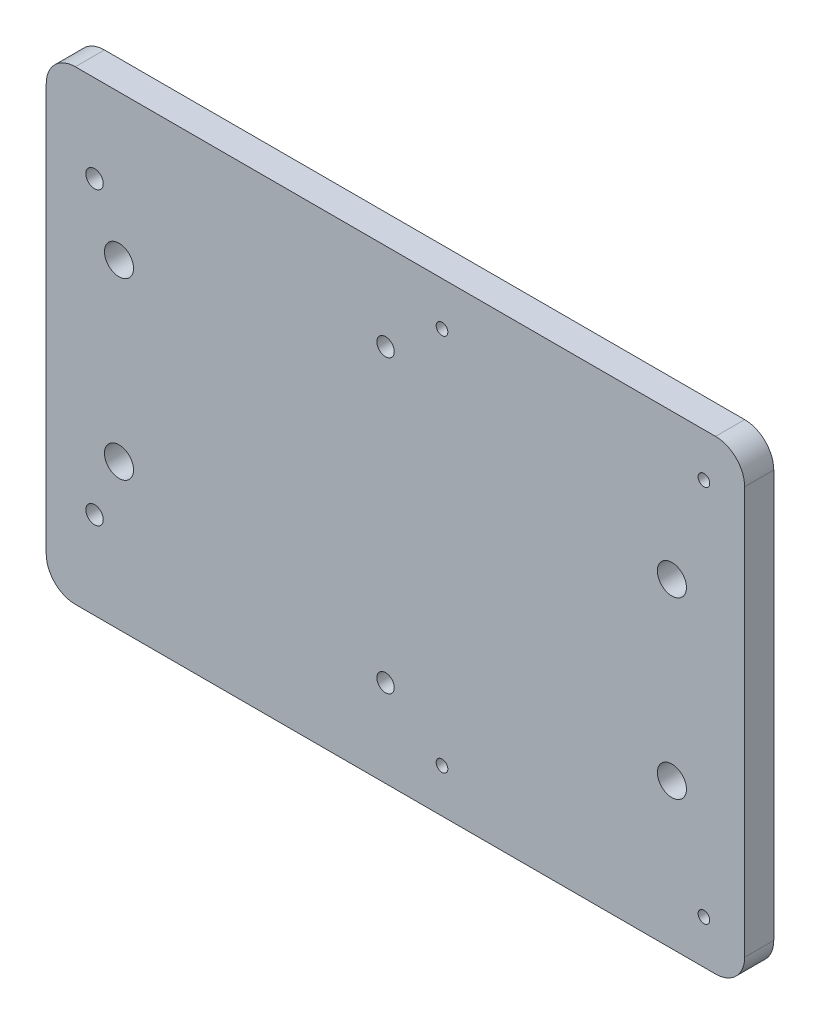
ISO-10303-21;
HEADER;
FILE_DESCRIPTION(('STEP AP214'),'2;1');
FILE_NAME('part.step','',(''),(''),'','','');
FILE_SCHEMA(('AUTOMOTIVE_DESIGN { 1 0 10303 214 1 1 1 1 }'));
ENDSEC;
DATA;
#1=APPLICATION_CONTEXT('core data for automotive mechanical design processes');
#2=APPLICATION_PROTOCOL_DEFINITION('international standard','automotive_design',2000,#1);
#3=PRODUCT_CONTEXT('',#1,'mechanical');
#4=PRODUCT('Part','Part','',(#3));
#5=PRODUCT_RELATED_PRODUCT_CATEGORY('part','',(#4));
#6=PRODUCT_DEFINITION_FORMATION('','',#4);
#7=PRODUCT_DEFINITION_CONTEXT('part definition',#1,'design');
#8=PRODUCT_DEFINITION('design','',#6,#7);
#9=PRODUCT_DEFINITION_SHAPE('','',#8);
#10=(LENGTH_UNIT() NAMED_UNIT(*) SI_UNIT(.MILLI.,.METRE.));
#11=(NAMED_UNIT(*) PLANE_ANGLE_UNIT() SI_UNIT($,.RADIAN.));
#12=(NAMED_UNIT(*) SI_UNIT($,.STERADIAN.) SOLID_ANGLE_UNIT());
#13=UNCERTAINTY_MEASURE_WITH_UNIT(LENGTH_MEASURE(1.E-05),#10,'distance_accuracy_value','');
#14=(GEOMETRIC_REPRESENTATION_CONTEXT(3) GLOBAL_UNCERTAINTY_ASSIGNED_CONTEXT((#13)) GLOBAL_UNIT_ASSIGNED_CONTEXT((#10,
#11,#12)) REPRESENTATION_CONTEXT('',''));
#15=CARTESIAN_POINT('',(0.,0.,0.));
#16=DIRECTION('',(0.,0.,1.));
#17=DIRECTION('',(1.,0.,0.));
#18=AXIS2_PLACEMENT_3D('',#15,#16,#17);
#19=CARTESIAN_POINT('',(0.,0.,5.));
#20=DIRECTION('',(0.,0.,1.));
#21=DIRECTION('',(1.,0.,0.));
#22=AXIS2_PLACEMENT_3D('',#19,#20,#21);
#23=PLANE('',#22);
#24=CARTESIAN_POINT('',(7.99999999999997,-32.5,5.));
#25=DIRECTION('',(0.,0.,1.));
#26=DIRECTION('',(1.,0.,0.));
#27=AXIS2_PLACEMENT_3D('',#24,#25,#26);
#28=CIRCLE('',#27,0.999999999999998);
#29=CARTESIAN_POINT('',(8.99999999999997,-32.5,5.));
#30=VERTEX_POINT('',#29);
#31=EDGE_CURVE('E196',#30,#30,#28,.T.);
#32=ORIENTED_EDGE('',*,*,#31,.F.);
#33=EDGE_LOOP('',(#32));
#34=FACE_BOUND('',#33,.T.);
#35=CARTESIAN_POINT('',(-51.7022512528769,25.,5.));
#36=DIRECTION('',(0.,0.,1.));
#37=DIRECTION('',(1.,0.,0.));
#38=AXIS2_PLACEMENT_3D('',#35,#36,#37);
#39=CIRCLE('',#38,1.5);
#40=CARTESIAN_POINT('',(-50.2022512528769,25.,5.));
#41=VERTEX_POINT('',#40);
#42=EDGE_CURVE('E201',#41,#41,#39,.T.);
#43=ORIENTED_EDGE('',*,*,#42,.F.);
#44=EDGE_LOOP('',(#43));
#45=FACE_BOUND('',#44,.T.);
#46=CARTESIAN_POINT('',(-1.70225125287687,25.,5.));
#47=DIRECTION('',(0.,0.,1.));
#48=DIRECTION('',(1.,0.,0.));
#49=AXIS2_PLACEMENT_3D('',#46,#47,#48);
#50=CIRCLE('',#49,1.5);
#51=CARTESIAN_POINT('',(-0.202251252876872,25.,5.));
#52=VERTEX_POINT('',#51);
#53=EDGE_CURVE('E204',#52,#52,#50,.T.);
#54=ORIENTED_EDGE('',*,*,#53,.F.);
#55=EDGE_LOOP('',(#54));
#56=FACE_BOUND('',#55,.T.);
#57=CARTESIAN_POINT('',(-1.70225125287687,-25.,5.));
#58=DIRECTION('',(0.,0.,1.));
#59=DIRECTION('',(1.,0.,0.));
#60=AXIS2_PLACEMENT_3D('',#57,#58,#59);
#61=CIRCLE('',#60,1.5);
#62=CARTESIAN_POINT('',(-0.202251252876865,-25.,5.));
#63=VERTEX_POINT('',#62);
#64=EDGE_CURVE('E207',#63,#63,#61,.T.);
#65=ORIENTED_EDGE('',*,*,#64,.F.);
#66=EDGE_LOOP('',(#65));
#67=FACE_BOUND('',#66,.T.);
#68=CARTESIAN_POINT('',(53.,-32.5,5.));
#69=DIRECTION('',(0.,0.,1.));
#70=DIRECTION('',(1.,0.,0.));
#71=AXIS2_PLACEMENT_3D('',#68,#69,#70);
#72=CIRCLE('',#71,0.999999999999998);
#73=CARTESIAN_POINT('',(54.,-32.5,5.));
#74=VERTEX_POINT('',#73);
#75=EDGE_CURVE('E210',#74,#74,#72,.T.);
#76=ORIENTED_EDGE('',*,*,#75,.F.);
#77=EDGE_LOOP('',(#76));
#78=FACE_BOUND('',#77,.T.);
#79=CARTESIAN_POINT('',(53.,32.5,5.));
#80=DIRECTION('',(0.,0.,1.));
#81=DIRECTION('',(1.,0.,0.));
#82=AXIS2_PLACEMENT_3D('',#79,#80,#81);
#83=CIRCLE('',#82,0.999999999999998);
#84=CARTESIAN_POINT('',(54.,32.5,5.));
#85=VERTEX_POINT('',#84);
#86=EDGE_CURVE('E213',#85,#85,#83,.T.);
#87=ORIENTED_EDGE('',*,*,#86,.F.);
#88=EDGE_LOOP('',(#87));
#89=FACE_BOUND('',#88,.T.);
#90=CARTESIAN_POINT('',(7.99999999999997,32.5,5.));
#91=DIRECTION('',(0.,0.,1.));
#92=DIRECTION('',(1.,0.,0.));
#93=AXIS2_PLACEMENT_3D('',#90,#91,#92);
#94=CIRCLE('',#93,0.999999999999998);
#95=CARTESIAN_POINT('',(8.99999999999996,32.5,5.));
#96=VERTEX_POINT('',#95);
#97=EDGE_CURVE('E216',#96,#96,#94,.T.);
#98=ORIENTED_EDGE('',*,*,#97,.F.);
#99=EDGE_LOOP('',(#98));
#100=FACE_BOUND('',#99,.T.);
#101=CARTESIAN_POINT('',(-51.7022512528769,-25.,5.));
#102=DIRECTION('',(0.,0.,1.));
#103=DIRECTION('',(1.,0.,0.));
#104=AXIS2_PLACEMENT_3D('',#101,#102,#103);
#105=CIRCLE('',#104,1.5);
#106=CARTESIAN_POINT('',(-50.2022512528769,-25.,5.));
#107=VERTEX_POINT('',#106);
#108=EDGE_CURVE('E219',#107,#107,#105,.T.);
#109=ORIENTED_EDGE('',*,*,#108,.F.);
#110=EDGE_LOOP('',(#109));
#111=FACE_BOUND('',#110,.T.);
#112=CARTESIAN_POINT('',(47.5,-15.,5.));
#113=DIRECTION('',(0.,0.,1.));
#114=DIRECTION('',(1.,0.,0.));
#115=AXIS2_PLACEMENT_3D('',#112,#113,#114);
#116=CIRCLE('',#115,2.49999999999999);
#117=CARTESIAN_POINT('',(50.,-15.,5.));
#118=VERTEX_POINT('',#117);
#119=EDGE_CURVE('E184',#118,#118,#116,.T.);
#120=ORIENTED_EDGE('',*,*,#119,.F.);
#121=EDGE_LOOP('',(#120));
#122=FACE_BOUND('',#121,.T.);
#123=CARTESIAN_POINT('',(-47.5,15.,5.));
#124=DIRECTION('',(0.,0.,1.));
#125=DIRECTION('',(1.,0.,0.));
#126=AXIS2_PLACEMENT_3D('',#123,#124,#125);
#127=CIRCLE('',#126,2.49999999999999);
#128=CARTESIAN_POINT('',(-45.,15.,5.));
#129=VERTEX_POINT('',#128);
#130=EDGE_CURVE('E167',#129,#129,#127,.T.);
#131=ORIENTED_EDGE('',*,*,#130,.F.);
#132=EDGE_LOOP('',(#131));
#133=FACE_BOUND('',#132,.T.);
#134=DIRECTION('',(0.,-1.,0.));
#135=VECTOR('',#134,1.);
#136=CARTESIAN_POINT('',(-60.,40.,5.));
#137=LINE('',#136,#135);
#138=CARTESIAN_POINT('',(-60.,35.,5.));
#139=VERTEX_POINT('',#138);
#140=CARTESIAN_POINT('',(-60.,-35.,5.));
#141=VERTEX_POINT('',#140);
#142=EDGE_CURVE('E174',#139,#141,#137,.T.);
#143=ORIENTED_EDGE('',*,*,#142,.T.);
#144=CARTESIAN_POINT('',(-55.,-35.,5.));
#145=DIRECTION('',(0.,0.,1.));
#146=DIRECTION('',(1.,0.,0.));
#147=AXIS2_PLACEMENT_3D('',#144,#145,#146);
#148=CIRCLE('',#147,5.);
#149=CARTESIAN_POINT('',(-55.,-40.,5.));
#150=VERTEX_POINT('',#149);
#151=EDGE_CURVE('E151',#141,#150,#148,.T.);
#152=ORIENTED_EDGE('',*,*,#151,.T.);
#153=DIRECTION('',(1.,0.,0.));
#154=VECTOR('',#153,1.);
#155=CARTESIAN_POINT('',(-60.,-40.,5.));
#156=LINE('',#155,#154);
#157=CARTESIAN_POINT('',(55.,-40.,5.));
#158=VERTEX_POINT('',#157);
#159=EDGE_CURVE('E122',#150,#158,#156,.T.);
#160=ORIENTED_EDGE('',*,*,#159,.T.);
#161=CARTESIAN_POINT('',(55.,-35.,5.));
#162=DIRECTION('',(0.,0.,1.));
#163=DIRECTION('',(1.,0.,0.));
#164=AXIS2_PLACEMENT_3D('',#161,#162,#163);
#165=CIRCLE('',#164,5.);
#166=CARTESIAN_POINT('',(60.,-35.,5.));
#167=VERTEX_POINT('',#166);
#168=EDGE_CURVE('E146',#158,#167,#165,.T.);
#169=ORIENTED_EDGE('',*,*,#168,.T.);
#170=DIRECTION('',(0.,1.,0.));
#171=VECTOR('',#170,1.);
#172=CARTESIAN_POINT('',(60.,40.,5.));
#173=LINE('',#172,#171);
#174=CARTESIAN_POINT('',(60.,35.,5.));
#175=VERTEX_POINT('',#174);
#176=EDGE_CURVE('E129',#167,#175,#173,.T.);
#177=ORIENTED_EDGE('',*,*,#176,.T.);
#178=CARTESIAN_POINT('',(55.,35.,5.));
#179=DIRECTION('',(0.,0.,1.));
#180=DIRECTION('',(1.,0.,0.));
#181=AXIS2_PLACEMENT_3D('',#178,#179,#180);
#182=CIRCLE('',#181,5.);
#183=CARTESIAN_POINT('',(55.,40.,5.));
#184=VERTEX_POINT('',#183);
#185=EDGE_CURVE('E58',#175,#184,#182,.T.);
#186=ORIENTED_EDGE('',*,*,#185,.T.);
#187=DIRECTION('',(-1.,0.,0.));
#188=VECTOR('',#187,1.);
#189=CARTESIAN_POINT('',(-60.,40.,5.));
#190=LINE('',#189,#188);
#191=CARTESIAN_POINT('',(-55.,40.,5.));
#192=VERTEX_POINT('',#191);
#193=EDGE_CURVE('E132',#184,#192,#190,.T.);
#194=ORIENTED_EDGE('',*,*,#193,.T.);
#195=CARTESIAN_POINT('',(-55.,35.,5.));
#196=DIRECTION('',(0.,0.,1.));
#197=DIRECTION('',(1.,0.,0.));
#198=AXIS2_PLACEMENT_3D('',#195,#196,#197);
#199=CIRCLE('',#198,5.);
#200=EDGE_CURVE('E149',#192,#139,#199,.T.);
#201=ORIENTED_EDGE('',*,*,#200,.T.);
#202=EDGE_LOOP('',(#143,#152,#160,#169,#177,#186,#194,#201));
#203=FACE_BOUND('',#202,.T.);
#204=CARTESIAN_POINT('',(47.5,15.,5.));
#205=DIRECTION('',(0.,0.,1.));
#206=DIRECTION('',(-1.,0.,0.));
#207=AXIS2_PLACEMENT_3D('',#204,#205,#206);
#208=CIRCLE('',#207,2.49999999999999);
#209=CARTESIAN_POINT('',(45.,15.,5.));
#210=VERTEX_POINT('',#209);
#211=EDGE_CURVE('E179',#210,#210,#208,.T.);
#212=ORIENTED_EDGE('',*,*,#211,.F.);
#213=EDGE_LOOP('',(#212));
#214=FACE_BOUND('',#213,.T.);
#215=CARTESIAN_POINT('',(-47.5,-15.,5.));
#216=DIRECTION('',(0.,0.,1.));
#217=DIRECTION('',(-1.,0.,0.));
#218=AXIS2_PLACEMENT_3D('',#215,#216,#217);
#219=CIRCLE('',#218,2.49999999999999);
#220=CARTESIAN_POINT('',(-50.,-15.,5.));
#221=VERTEX_POINT('',#220);
#222=EDGE_CURVE('E190',#221,#221,#219,.T.);
#223=ORIENTED_EDGE('',*,*,#222,.F.);
#224=EDGE_LOOP('',(#223));
#225=FACE_BOUND('',#224,.T.);
#226=ADVANCED_FACE('F36',(#34,#45,#56,#67,#78,#89,#100,#111,#122,#133,#203,#214,#225),#23,.T.);
#227=CARTESIAN_POINT('',(0.,0.,0.));
#228=DIRECTION('',(0.,0.,1.));
#229=DIRECTION('',(1.,0.,0.));
#230=AXIS2_PLACEMENT_3D('',#227,#228,#229);
#231=PLANE('',#230);
#232=CARTESIAN_POINT('',(7.99999999999997,-32.5,0.));
#233=DIRECTION('',(0.,0.,-1.));
#234=DIRECTION('',(-1.,0.,0.));
#235=AXIS2_PLACEMENT_3D('',#232,#233,#234);
#236=CIRCLE('',#235,0.999999999999998);
#237=CARTESIAN_POINT('',(6.99999999999997,-32.5,0.));
#238=VERTEX_POINT('',#237);
#239=EDGE_CURVE('E232',#238,#238,#236,.T.);
#240=ORIENTED_EDGE('',*,*,#239,.F.);
#241=EDGE_LOOP('',(#240));
#242=FACE_BOUND('',#241,.T.);
#243=CARTESIAN_POINT('',(-51.7022512528769,25.,0.));
#244=DIRECTION('',(0.,0.,-1.));
#245=DIRECTION('',(-1.,0.,0.));
#246=AXIS2_PLACEMENT_3D('',#243,#244,#245);
#247=CIRCLE('',#246,1.5);
#248=CARTESIAN_POINT('',(-53.2022512528769,25.,0.));
#249=VERTEX_POINT('',#248);
#250=EDGE_CURVE('E229',#249,#249,#247,.T.);
#251=ORIENTED_EDGE('',*,*,#250,.F.);
#252=EDGE_LOOP('',(#251));
#253=FACE_BOUND('',#252,.T.);
#254=CARTESIAN_POINT('',(-1.70225125287687,25.,0.));
#255=DIRECTION('',(0.,0.,-1.));
#256=DIRECTION('',(-1.,0.,0.));
#257=AXIS2_PLACEMENT_3D('',#254,#255,#256);
#258=CIRCLE('',#257,1.5);
#259=CARTESIAN_POINT('',(-3.20225125287688,25.,0.));
#260=VERTEX_POINT('',#259);
#261=EDGE_CURVE('E226',#260,#260,#258,.T.);
#262=ORIENTED_EDGE('',*,*,#261,.F.);
#263=EDGE_LOOP('',(#262));
#264=FACE_BOUND('',#263,.T.);
#265=CARTESIAN_POINT('',(-1.70225125287687,-25.,0.));
#266=DIRECTION('',(0.,0.,-1.));
#267=DIRECTION('',(-1.,0.,0.));
#268=AXIS2_PLACEMENT_3D('',#265,#266,#267);
#269=CIRCLE('',#268,1.5);
#270=CARTESIAN_POINT('',(-3.20225125287687,-25.,0.));
#271=VERTEX_POINT('',#270);
#272=EDGE_CURVE('E225',#271,#271,#269,.T.);
#273=ORIENTED_EDGE('',*,*,#272,.F.);
#274=EDGE_LOOP('',(#273));
#275=FACE_BOUND('',#274,.T.);
#276=CARTESIAN_POINT('',(53.,-32.5,0.));
#277=DIRECTION('',(0.,0.,-1.));
#278=DIRECTION('',(-1.,0.,0.));
#279=AXIS2_PLACEMENT_3D('',#276,#277,#278);
#280=CIRCLE('',#279,0.999999999999998);
#281=CARTESIAN_POINT('',(52.,-32.5,0.));
#282=VERTEX_POINT('',#281);
#283=EDGE_CURVE('E235',#282,#282,#280,.T.);
#284=ORIENTED_EDGE('',*,*,#283,.F.);
#285=EDGE_LOOP('',(#284));
#286=FACE_BOUND('',#285,.T.);
#287=CARTESIAN_POINT('',(53.,32.5,0.));
#288=DIRECTION('',(0.,0.,-1.));
#289=DIRECTION('',(-1.,0.,0.));
#290=AXIS2_PLACEMENT_3D('',#287,#288,#289);
#291=CIRCLE('',#290,0.999999999999998);
#292=CARTESIAN_POINT('',(52.,32.5,0.));
#293=VERTEX_POINT('',#292);
#294=EDGE_CURVE('E241',#293,#293,#291,.T.);
#295=ORIENTED_EDGE('',*,*,#294,.F.);
#296=EDGE_LOOP('',(#295));
#297=FACE_BOUND('',#296,.T.);
#298=CARTESIAN_POINT('',(7.99999999999997,32.5,0.));
#299=DIRECTION('',(0.,0.,-1.));
#300=DIRECTION('',(-1.,0.,0.));
#301=AXIS2_PLACEMENT_3D('',#298,#299,#300);
#302=CIRCLE('',#301,0.999999999999998);
#303=CARTESIAN_POINT('',(6.99999999999997,32.5,0.));
#304=VERTEX_POINT('',#303);
#305=EDGE_CURVE('E238',#304,#304,#302,.T.);
#306=ORIENTED_EDGE('',*,*,#305,.F.);
#307=EDGE_LOOP('',(#306));
#308=FACE_BOUND('',#307,.T.);
#309=CARTESIAN_POINT('',(-51.7022512528769,-25.,0.));
#310=DIRECTION('',(0.,0.,-1.));
#311=DIRECTION('',(-1.,0.,0.));
#312=AXIS2_PLACEMENT_3D('',#309,#310,#311);
#313=CIRCLE('',#312,1.5);
#314=CARTESIAN_POINT('',(-53.2022512528769,-25.,0.));
#315=VERTEX_POINT('',#314);
#316=EDGE_CURVE('E222',#315,#315,#313,.T.);
#317=ORIENTED_EDGE('',*,*,#316,.F.);
#318=EDGE_LOOP('',(#317));
#319=FACE_BOUND('',#318,.T.);
#320=DIRECTION('',(1.,0.,0.));
#321=VECTOR('',#320,1.);
#322=CARTESIAN_POINT('',(-60.,-40.,0.));
#323=LINE('',#322,#321);
#324=CARTESIAN_POINT('',(-55.,-40.,0.));
#325=VERTEX_POINT('',#324);
#326=CARTESIAN_POINT('',(55.,-40.,0.));
#327=VERTEX_POINT('',#326);
#328=EDGE_CURVE('E119',#325,#327,#323,.T.);
#329=ORIENTED_EDGE('',*,*,#328,.F.);
#330=CARTESIAN_POINT('',(-55.,-35.,0.));
#331=DIRECTION('',(0.,0.,1.));
#332=DIRECTION('',(1.,0.,0.));
#333=AXIS2_PLACEMENT_3D('',#330,#331,#332);
#334=CIRCLE('',#333,5.);
#335=CARTESIAN_POINT('',(-60.,-35.,0.));
#336=VERTEX_POINT('',#335);
#337=EDGE_CURVE('E102',#325,#336,#334,.F.);
#338=ORIENTED_EDGE('',*,*,#337,.T.);
#339=DIRECTION('',(0.,-1.,0.));
#340=VECTOR('',#339,1.);
#341=CARTESIAN_POINT('',(-60.,40.,0.));
#342=LINE('',#341,#340);
#343=CARTESIAN_POINT('',(-60.,35.,0.));
#344=VERTEX_POINT('',#343);
#345=EDGE_CURVE('E130',#344,#336,#342,.T.);
#346=ORIENTED_EDGE('',*,*,#345,.F.);
#347=CARTESIAN_POINT('',(-55.,35.,0.));
#348=DIRECTION('',(0.,0.,1.));
#349=DIRECTION('',(1.,0.,0.));
#350=AXIS2_PLACEMENT_3D('',#347,#348,#349);
#351=CIRCLE('',#350,5.);
#352=CARTESIAN_POINT('',(-55.,40.,0.));
#353=VERTEX_POINT('',#352);
#354=EDGE_CURVE('E113',#344,#353,#351,.F.);
#355=ORIENTED_EDGE('',*,*,#354,.T.);
#356=DIRECTION('',(-1.,0.,0.));
#357=VECTOR('',#356,1.);
#358=CARTESIAN_POINT('',(-60.,40.,0.));
#359=LINE('',#358,#357);
#360=CARTESIAN_POINT('',(55.,40.,0.));
#361=VERTEX_POINT('',#360);
#362=EDGE_CURVE('E134',#361,#353,#359,.T.);
#363=ORIENTED_EDGE('',*,*,#362,.F.);
#364=CARTESIAN_POINT('',(55.,35.,0.));
#365=DIRECTION('',(0.,0.,1.));
#366=DIRECTION('',(1.,0.,0.));
#367=AXIS2_PLACEMENT_3D('',#364,#365,#366);
#368=CIRCLE('',#367,5.);
#369=CARTESIAN_POINT('',(60.,35.,0.));
#370=VERTEX_POINT('',#369);
#371=EDGE_CURVE('E140',#361,#370,#368,.F.);
#372=ORIENTED_EDGE('',*,*,#371,.T.);
#373=DIRECTION('',(0.,1.,0.));
#374=VECTOR('',#373,1.);
#375=CARTESIAN_POINT('',(60.,40.,0.));
#376=LINE('',#375,#374);
#377=CARTESIAN_POINT('',(60.,-35.,0.));
#378=VERTEX_POINT('',#377);
#379=EDGE_CURVE('E162',#378,#370,#376,.T.);
#380=ORIENTED_EDGE('',*,*,#379,.F.);
#381=CARTESIAN_POINT('',(55.,-35.,0.));
#382=DIRECTION('',(0.,0.,1.));
#383=DIRECTION('',(1.,0.,0.));
#384=AXIS2_PLACEMENT_3D('',#381,#382,#383);
#385=CIRCLE('',#384,5.);
#386=EDGE_CURVE('E123',#378,#327,#385,.F.);
#387=ORIENTED_EDGE('',*,*,#386,.T.);
#388=EDGE_LOOP('',(#329,#338,#346,#355,#363,#372,#380,#387));
#389=FACE_BOUND('',#388,.T.);
#390=CARTESIAN_POINT('',(-47.5,15.,0.));
#391=DIRECTION('',(0.,0.,1.));
#392=DIRECTION('',(1.,0.,0.));
#393=AXIS2_PLACEMENT_3D('',#390,#391,#392);
#394=CIRCLE('',#393,2.49999999999999);
#395=CARTESIAN_POINT('',(-45.,15.,0.));
#396=VERTEX_POINT('',#395);
#397=EDGE_CURVE('E170',#396,#396,#394,.T.);
#398=ORIENTED_EDGE('',*,*,#397,.T.);
#399=EDGE_LOOP('',(#398));
#400=FACE_BOUND('',#399,.T.);
#401=CARTESIAN_POINT('',(47.5,15.,0.));
#402=DIRECTION('',(0.,0.,1.));
#403=DIRECTION('',(-1.,0.,0.));
#404=AXIS2_PLACEMENT_3D('',#401,#402,#403);
#405=CIRCLE('',#404,2.49999999999999);
#406=CARTESIAN_POINT('',(45.,15.,0.));
#407=VERTEX_POINT('',#406);
#408=EDGE_CURVE('E181',#407,#407,#405,.T.);
#409=ORIENTED_EDGE('',*,*,#408,.T.);
#410=EDGE_LOOP('',(#409));
#411=FACE_BOUND('',#410,.T.);
#412=CARTESIAN_POINT('',(47.5,-15.,0.));
#413=DIRECTION('',(0.,0.,1.));
#414=DIRECTION('',(1.,0.,0.));
#415=AXIS2_PLACEMENT_3D('',#412,#413,#414);
#416=CIRCLE('',#415,2.49999999999999);
#417=CARTESIAN_POINT('',(50.,-15.,0.));
#418=VERTEX_POINT('',#417);
#419=EDGE_CURVE('E187',#418,#418,#416,.T.);
#420=ORIENTED_EDGE('',*,*,#419,.T.);
#421=EDGE_LOOP('',(#420));
#422=FACE_BOUND('',#421,.T.);
#423=CARTESIAN_POINT('',(-47.5,-15.,0.));
#424=DIRECTION('',(0.,0.,1.));
#425=DIRECTION('',(-1.,0.,0.));
#426=AXIS2_PLACEMENT_3D('',#423,#424,#425);
#427=CIRCLE('',#426,2.49999999999999);
#428=CARTESIAN_POINT('',(-50.,-15.,0.));
#429=VERTEX_POINT('',#428);
#430=EDGE_CURVE('E193',#429,#429,#427,.T.);
#431=ORIENTED_EDGE('',*,*,#430,.T.);
#432=EDGE_LOOP('',(#431));
#433=FACE_BOUND('',#432,.T.);
#434=ADVANCED_FACE('F126',(#242,#253,#264,#275,#286,#297,#308,#319,#389,#400,#411,#422,#433),
#231,.F.);
#435=CARTESIAN_POINT('',(60.,40.,5.));
#436=DIRECTION('',(-1.,0.,0.));
#437=DIRECTION('',(0.,-1.,0.));
#438=AXIS2_PLACEMENT_3D('',#435,#436,#437);
#439=PLANE('',#438);
#440=ORIENTED_EDGE('',*,*,#379,.T.);
#441=DIRECTION('',(0.,0.,-1.));
#442=VECTOR('',#441,1.);
#443=CARTESIAN_POINT('',(60.,35.,5.));
#444=LINE('',#443,#442);
#445=EDGE_CURVE('E11',#370,#175,#444,.F.);
#446=ORIENTED_EDGE('',*,*,#445,.T.);
#447=ORIENTED_EDGE('',*,*,#176,.F.);
#448=DIRECTION('',(0.,0.,-1.));
#449=VECTOR('',#448,1.);
#450=CARTESIAN_POINT('',(60.,-35.,5.));
#451=LINE('',#450,#449);
#452=EDGE_CURVE('E44',#167,#378,#451,.T.);
#453=ORIENTED_EDGE('',*,*,#452,.T.);
#454=EDGE_LOOP('',(#440,#446,#447,#453));
#455=FACE_BOUND('',#454,.T.);
#456=ADVANCED_FACE('F161',(#455),#439,.F.);
#457=CARTESIAN_POINT('',(-60.,40.,5.));
#458=DIRECTION('',(0.,-1.,0.));
#459=DIRECTION('',(0.,0.,-1.));
#460=AXIS2_PLACEMENT_3D('',#457,#458,#459);
#461=PLANE('',#460);
#462=ORIENTED_EDGE('',*,*,#362,.T.);
#463=DIRECTION('',(0.,0.,-1.));
#464=VECTOR('',#463,1.);
#465=CARTESIAN_POINT('',(-55.,40.,5.));
#466=LINE('',#465,#464);
#467=EDGE_CURVE('E51',#353,#192,#466,.F.);
#468=ORIENTED_EDGE('',*,*,#467,.T.);
#469=ORIENTED_EDGE('',*,*,#193,.F.);
#470=DIRECTION('',(0.,0.,-1.));
#471=VECTOR('',#470,1.);
#472=CARTESIAN_POINT('',(55.,40.,5.));
#473=LINE('',#472,#471);
#474=EDGE_CURVE('E153',#184,#361,#473,.T.);
#475=ORIENTED_EDGE('',*,*,#474,.T.);
#476=EDGE_LOOP('',(#462,#468,#469,#475));
#477=FACE_BOUND('',#476,.T.);
#478=ADVANCED_FACE('F292',(#477),#461,.F.);
#479=CARTESIAN_POINT('',(-60.,40.,5.));
#480=DIRECTION('',(1.,0.,0.));
#481=DIRECTION('',(0.,1.,0.));
#482=AXIS2_PLACEMENT_3D('',#479,#480,#481);
#483=PLANE('',#482);
#484=ORIENTED_EDGE('',*,*,#345,.T.);
#485=DIRECTION('',(0.,0.,-1.));
#486=VECTOR('',#485,1.);
#487=CARTESIAN_POINT('',(-60.,-35.,5.));
#488=LINE('',#487,#486);
#489=EDGE_CURVE('E107',#336,#141,#488,.F.);
#490=ORIENTED_EDGE('',*,*,#489,.T.);
#491=ORIENTED_EDGE('',*,*,#142,.F.);
#492=DIRECTION('',(0.,0.,-1.));
#493=VECTOR('',#492,1.);
#494=CARTESIAN_POINT('',(-60.,35.,5.));
#495=LINE('',#494,#493);
#496=EDGE_CURVE('E112',#139,#344,#495,.T.);
#497=ORIENTED_EDGE('',*,*,#496,.T.);
#498=EDGE_LOOP('',(#484,#490,#491,#497));
#499=FACE_BOUND('',#498,.T.);
#500=ADVANCED_FACE('F289',(#499),#483,.F.);
#501=CARTESIAN_POINT('',(-60.,-40.,5.));
#502=DIRECTION('',(0.,1.,0.));
#503=DIRECTION('',(0.,0.,1.));
#504=AXIS2_PLACEMENT_3D('',#501,#502,#503);
#505=PLANE('',#504);
#506=ORIENTED_EDGE('',*,*,#159,.F.);
#507=DIRECTION('',(0.,0.,-1.));
#508=VECTOR('',#507,1.);
#509=CARTESIAN_POINT('',(-55.,-40.,5.));
#510=LINE('',#509,#508);
#511=EDGE_CURVE('E106',#150,#325,#510,.T.);
#512=ORIENTED_EDGE('',*,*,#511,.T.);
#513=ORIENTED_EDGE('',*,*,#328,.T.);
#514=DIRECTION('',(0.,0.,-1.));
#515=VECTOR('',#514,1.);
#516=CARTESIAN_POINT('',(55.,-40.,5.));
#517=LINE('',#516,#515);
#518=EDGE_CURVE('E124',#327,#158,#517,.F.);
#519=ORIENTED_EDGE('',*,*,#518,.T.);
#520=EDGE_LOOP('',(#506,#512,#513,#519));
#521=FACE_BOUND('',#520,.T.);
#522=ADVANCED_FACE('F118',(#521),#505,.F.);
#523=CARTESIAN_POINT('',(-47.5,15.,5.));
#524=DIRECTION('',(0.,0.,-1.));
#525=DIRECTION('',(-1.,0.,0.));
#526=AXIS2_PLACEMENT_3D('',#523,#524,#525);
#527=CYLINDRICAL_SURFACE('',#526,2.49999999999999);
#528=ORIENTED_EDGE('',*,*,#130,.T.);
#529=EDGE_LOOP('',(#528));
#530=FACE_BOUND('',#529,.T.);
#531=ORIENTED_EDGE('',*,*,#397,.F.);
#532=EDGE_LOOP('',(#531));
#533=FACE_BOUND('',#532,.T.);
#534=ADVANCED_FACE('F284',(#530,#533),#527,.F.);
#535=CARTESIAN_POINT('',(47.5,15.,5.));
#536=DIRECTION('',(0.,0.,-1.));
#537=DIRECTION('',(-1.,0.,0.));
#538=AXIS2_PLACEMENT_3D('',#535,#536,#537);
#539=CYLINDRICAL_SURFACE('',#538,2.49999999999999);
#540=ORIENTED_EDGE('',*,*,#211,.T.);
#541=EDGE_LOOP('',(#540));
#542=FACE_BOUND('',#541,.T.);
#543=ORIENTED_EDGE('',*,*,#408,.F.);
#544=EDGE_LOOP('',(#543));
#545=FACE_BOUND('',#544,.T.);
#546=ADVANCED_FACE('F322',(#542,#545),#539,.F.);
#547=CARTESIAN_POINT('',(47.5,-15.,5.));
#548=DIRECTION('',(0.,0.,-1.));
#549=DIRECTION('',(-1.,0.,0.));
#550=AXIS2_PLACEMENT_3D('',#547,#548,#549);
#551=CYLINDRICAL_SURFACE('',#550,2.49999999999999);
#552=ORIENTED_EDGE('',*,*,#119,.T.);
#553=EDGE_LOOP('',(#552));
#554=FACE_BOUND('',#553,.T.);
#555=ORIENTED_EDGE('',*,*,#419,.F.);
#556=EDGE_LOOP('',(#555));
#557=FACE_BOUND('',#556,.T.);
#558=ADVANCED_FACE('F272',(#554,#557),#551,.F.);
#559=CARTESIAN_POINT('',(-47.5,-15.,5.));
#560=DIRECTION('',(0.,0.,-1.));
#561=DIRECTION('',(-1.,0.,0.));
#562=AXIS2_PLACEMENT_3D('',#559,#560,#561);
#563=CYLINDRICAL_SURFACE('',#562,2.49999999999999);
#564=ORIENTED_EDGE('',*,*,#222,.T.);
#565=EDGE_LOOP('',(#564));
#566=FACE_BOUND('',#565,.T.);
#567=ORIENTED_EDGE('',*,*,#430,.F.);
#568=EDGE_LOOP('',(#567));
#569=FACE_BOUND('',#568,.T.);
#570=ADVANCED_FACE('F262',(#566,#569),#563,.F.);
#571=CARTESIAN_POINT('',(-51.7022512528769,-25.,10.));
#572=DIRECTION('',(0.,0.,-1.));
#573=DIRECTION('',(-1.,0.,0.));
#574=AXIS2_PLACEMENT_3D('',#571,#572,#573);
#575=CYLINDRICAL_SURFACE('',#574,1.5);
#576=ORIENTED_EDGE('',*,*,#108,.T.);
#577=EDGE_LOOP('',(#576));
#578=FACE_BOUND('',#577,.T.);
#579=ORIENTED_EDGE('',*,*,#316,.T.);
#580=EDGE_LOOP('',(#579));
#581=FACE_BOUND('',#580,.T.);
#582=ADVANCED_FACE('F259',(#578,#581),#575,.F.);
#583=CARTESIAN_POINT('',(7.99999999999997,32.5,10.));
#584=DIRECTION('',(0.,0.,-1.));
#585=DIRECTION('',(-1.,0.,0.));
#586=AXIS2_PLACEMENT_3D('',#583,#584,#585);
#587=CYLINDRICAL_SURFACE('',#586,0.999999999999998);
#588=ORIENTED_EDGE('',*,*,#97,.T.);
#589=EDGE_LOOP('',(#588));
#590=FACE_BOUND('',#589,.T.);
#591=ORIENTED_EDGE('',*,*,#305,.T.);
#592=EDGE_LOOP('',(#591));
#593=FACE_BOUND('',#592,.T.);
#594=ADVANCED_FACE('F261',(#590,#593),#587,.F.);
#595=CARTESIAN_POINT('',(53.,32.5,10.));
#596=DIRECTION('',(0.,0.,-1.));
#597=DIRECTION('',(-1.,0.,0.));
#598=AXIS2_PLACEMENT_3D('',#595,#596,#597);
#599=CYLINDRICAL_SURFACE('',#598,0.999999999999998);
#600=ORIENTED_EDGE('',*,*,#86,.T.);
#601=EDGE_LOOP('',(#600));
#602=FACE_BOUND('',#601,.T.);
#603=ORIENTED_EDGE('',*,*,#294,.T.);
#604=EDGE_LOOP('',(#603));
#605=FACE_BOUND('',#604,.T.);
#606=ADVANCED_FACE('F269',(#602,#605),#599,.F.);
#607=CARTESIAN_POINT('',(53.,-32.5,10.));
#608=DIRECTION('',(0.,0.,-1.));
#609=DIRECTION('',(-1.,0.,0.));
#610=AXIS2_PLACEMENT_3D('',#607,#608,#609);
#611=CYLINDRICAL_SURFACE('',#610,0.999999999999998);
#612=ORIENTED_EDGE('',*,*,#75,.T.);
#613=EDGE_LOOP('',(#612));
#614=FACE_BOUND('',#613,.T.);
#615=ORIENTED_EDGE('',*,*,#283,.T.);
#616=EDGE_LOOP('',(#615));
#617=FACE_BOUND('',#616,.T.);
#618=ADVANCED_FACE('F247',(#614,#617),#611,.F.);
#619=CARTESIAN_POINT('',(-1.70225125287687,-25.,10.));
#620=DIRECTION('',(0.,0.,-1.));
#621=DIRECTION('',(-1.,0.,0.));
#622=AXIS2_PLACEMENT_3D('',#619,#620,#621);
#623=CYLINDRICAL_SURFACE('',#622,1.5);
#624=ORIENTED_EDGE('',*,*,#64,.T.);
#625=EDGE_LOOP('',(#624));
#626=FACE_BOUND('',#625,.T.);
#627=ORIENTED_EDGE('',*,*,#272,.T.);
#628=EDGE_LOOP('',(#627));
#629=FACE_BOUND('',#628,.T.);
#630=ADVANCED_FACE('F389',(#626,#629),#623,.F.);
#631=CARTESIAN_POINT('',(-1.70225125287687,25.,10.));
#632=DIRECTION('',(0.,0.,-1.));
#633=DIRECTION('',(-1.,0.,0.));
#634=AXIS2_PLACEMENT_3D('',#631,#632,#633);
#635=CYLINDRICAL_SURFACE('',#634,1.5);
#636=ORIENTED_EDGE('',*,*,#53,.T.);
#637=EDGE_LOOP('',(#636));
#638=FACE_BOUND('',#637,.T.);
#639=ORIENTED_EDGE('',*,*,#261,.T.);
#640=EDGE_LOOP('',(#639));
#641=FACE_BOUND('',#640,.T.);
#642=ADVANCED_FACE('F399',(#638,#641),#635,.F.);
#643=CARTESIAN_POINT('',(-51.7022512528769,25.,10.));
#644=DIRECTION('',(0.,0.,-1.));
#645=DIRECTION('',(-1.,0.,0.));
#646=AXIS2_PLACEMENT_3D('',#643,#644,#645);
#647=CYLINDRICAL_SURFACE('',#646,1.5);
#648=ORIENTED_EDGE('',*,*,#42,.T.);
#649=EDGE_LOOP('',(#648));
#650=FACE_BOUND('',#649,.T.);
#651=ORIENTED_EDGE('',*,*,#250,.T.);
#652=EDGE_LOOP('',(#651));
#653=FACE_BOUND('',#652,.T.);
#654=ADVANCED_FACE('F409',(#650,#653),#647,.F.);
#655=CARTESIAN_POINT('',(7.99999999999997,-32.5,10.));
#656=DIRECTION('',(0.,0.,-1.));
#657=DIRECTION('',(-1.,0.,0.));
#658=AXIS2_PLACEMENT_3D('',#655,#656,#657);
#659=CYLINDRICAL_SURFACE('',#658,0.999999999999998);
#660=ORIENTED_EDGE('',*,*,#31,.T.);
#661=EDGE_LOOP('',(#660));
#662=FACE_BOUND('',#661,.T.);
#663=ORIENTED_EDGE('',*,*,#239,.T.);
#664=EDGE_LOOP('',(#663));
#665=FACE_BOUND('',#664,.T.);
#666=ADVANCED_FACE('F301',(#662,#665),#659,.F.);
#667=CARTESIAN_POINT('',(-55.,-35.,5.));
#668=DIRECTION('',(0.,0.,-1.));
#669=DIRECTION('',(-1.,0.,0.));
#670=AXIS2_PLACEMENT_3D('',#667,#668,#669);
#671=CYLINDRICAL_SURFACE('',#670,5.);
#672=ORIENTED_EDGE('',*,*,#151,.F.);
#673=ORIENTED_EDGE('',*,*,#489,.F.);
#674=ORIENTED_EDGE('',*,*,#337,.F.);
#675=ORIENTED_EDGE('',*,*,#511,.F.);
#676=EDGE_LOOP('',(#672,#673,#674,#675));
#677=FACE_BOUND('',#676,.T.);
#678=ADVANCED_FACE('F105',(#677),#671,.T.);
#679=CARTESIAN_POINT('',(-55.,35.,5.));
#680=DIRECTION('',(0.,0.,-1.));
#681=DIRECTION('',(-1.,0.,0.));
#682=AXIS2_PLACEMENT_3D('',#679,#680,#681);
#683=CYLINDRICAL_SURFACE('',#682,5.);
#684=ORIENTED_EDGE('',*,*,#200,.F.);
#685=ORIENTED_EDGE('',*,*,#467,.F.);
#686=ORIENTED_EDGE('',*,*,#354,.F.);
#687=ORIENTED_EDGE('',*,*,#496,.F.);
#688=EDGE_LOOP('',(#684,#685,#686,#687));
#689=FACE_BOUND('',#688,.T.);
#690=ADVANCED_FACE('F300',(#689),#683,.T.);
#691=CARTESIAN_POINT('',(55.,35.,5.));
#692=DIRECTION('',(0.,0.,-1.));
#693=DIRECTION('',(-1.,0.,0.));
#694=AXIS2_PLACEMENT_3D('',#691,#692,#693);
#695=CYLINDRICAL_SURFACE('',#694,5.);
#696=ORIENTED_EDGE('',*,*,#185,.F.);
#697=ORIENTED_EDGE('',*,*,#445,.F.);
#698=ORIENTED_EDGE('',*,*,#371,.F.);
#699=ORIENTED_EDGE('',*,*,#474,.F.);
#700=EDGE_LOOP('',(#696,#697,#698,#699));
#701=FACE_BOUND('',#700,.T.);
#702=ADVANCED_FACE('F303',(#701),#695,.T.);
#703=CARTESIAN_POINT('',(55.,-35.,5.));
#704=DIRECTION('',(0.,0.,-1.));
#705=DIRECTION('',(-1.,0.,0.));
#706=AXIS2_PLACEMENT_3D('',#703,#704,#705);
#707=CYLINDRICAL_SURFACE('',#706,5.);
#708=ORIENTED_EDGE('',*,*,#168,.F.);
#709=ORIENTED_EDGE('',*,*,#518,.F.);
#710=ORIENTED_EDGE('',*,*,#386,.F.);
#711=ORIENTED_EDGE('',*,*,#452,.F.);
#712=EDGE_LOOP('',(#708,#709,#710,#711));
#713=FACE_BOUND('',#712,.T.);
#714=ADVANCED_FACE('F38',(#713),#707,.T.);
#715=CLOSED_SHELL('',(#226,#434,#456,#478,#500,#522,#534,#546,#558,#570,#582,#594,#606,#618,
#630,#642,#654,#666,#678,#690,#702,#714));
#716=MANIFOLD_SOLID_BREP('B2',#715);
#717=ADVANCED_BREP_SHAPE_REPRESENTATION('',(#18,#716),#14);
#718=SHAPE_DEFINITION_REPRESENTATION(#9,#717);
ENDSEC;
END-ISO-10303-21;
